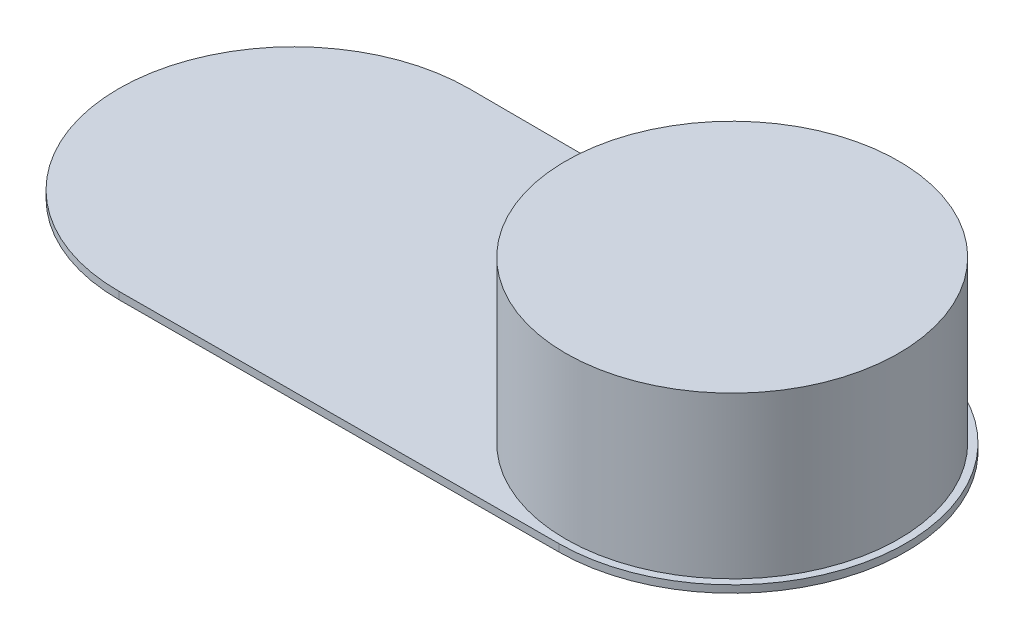
ISO-10303-21;
HEADER;
FILE_DESCRIPTION(('STEP AP214'),'2;1');
FILE_NAME('part.step','',(''),(''),'','','');
FILE_SCHEMA(('AUTOMOTIVE_DESIGN { 1 0 10303 214 1 1 1 1 }'));
ENDSEC;
DATA;
#1=APPLICATION_CONTEXT('core data for automotive mechanical design processes');
#2=APPLICATION_PROTOCOL_DEFINITION('international standard','automotive_design',2000,#1);
#3=PRODUCT_CONTEXT('',#1,'mechanical');
#4=PRODUCT('Part','Part','',(#3));
#5=PRODUCT_RELATED_PRODUCT_CATEGORY('part','',(#4));
#6=PRODUCT_DEFINITION_FORMATION('','',#4);
#7=PRODUCT_DEFINITION_CONTEXT('part definition',#1,'design');
#8=PRODUCT_DEFINITION('design','',#6,#7);
#9=PRODUCT_DEFINITION_SHAPE('','',#8);
#10=(LENGTH_UNIT() NAMED_UNIT(*) SI_UNIT(.MILLI.,.METRE.));
#11=(NAMED_UNIT(*) PLANE_ANGLE_UNIT() SI_UNIT($,.RADIAN.));
#12=(NAMED_UNIT(*) SI_UNIT($,.STERADIAN.) SOLID_ANGLE_UNIT());
#13=UNCERTAINTY_MEASURE_WITH_UNIT(LENGTH_MEASURE(1.E-05),#10,'distance_accuracy_value','');
#14=(GEOMETRIC_REPRESENTATION_CONTEXT(3) GLOBAL_UNCERTAINTY_ASSIGNED_CONTEXT((#13)) GLOBAL_UNIT_ASSIGNED_CONTEXT((#10,
#11,#12)) REPRESENTATION_CONTEXT('',''));
#15=CARTESIAN_POINT('',(0.,0.,0.));
#16=DIRECTION('',(0.,0.,1.));
#17=DIRECTION('',(1.,0.,0.));
#18=AXIS2_PLACEMENT_3D('',#15,#16,#17);
#19=CARTESIAN_POINT('',(0.,5.,0.));
#20=DIRECTION('',(0.,1.,0.));
#21=DIRECTION('',(0.,0.,1.));
#22=AXIS2_PLACEMENT_3D('',#19,#20,#21);
#23=PLANE('',#22);
#24=DIRECTION('',(0.999994444429012,0.,0.00333333333333333));
#25=VECTOR('',#24,1.);
#26=CARTESIAN_POINT('',(0.396666666666666,5.,-118.999338887052));
#27=LINE('',#26,#25);
#28=CARTESIAN_POINT('',(-299.6,5.,-119.999333331481));
#29=VERTEX_POINT('',#28);
#30=CARTESIAN_POINT('',(0.396666666666714,5.,-118.999338887052));
#31=VERTEX_POINT('',#30);
#32=EDGE_CURVE('E88',#29,#31,#27,.T.);
#33=ORIENTED_EDGE('',*,*,#32,.F.);
#34=CARTESIAN_POINT('',(-300.,5.,0.));
#35=DIRECTION('',(0.,1.,0.));
#36=DIRECTION('',(0.,0.,1.));
#37=AXIS2_PLACEMENT_3D('',#34,#35,#36);
#38=CIRCLE('',#37,120.);
#39=CARTESIAN_POINT('',(-299.6,5.,119.999333331481));
#40=VERTEX_POINT('',#39);
#41=EDGE_CURVE('E83',#29,#40,#38,.T.);
#42=ORIENTED_EDGE('',*,*,#41,.T.);
#43=DIRECTION('',(-0.999994444429012,0.,0.00333333333333328));
#44=VECTOR('',#43,1.);
#45=CARTESIAN_POINT('',(0.396666666666661,5.,118.999338887052));
#46=LINE('',#45,#44);
#47=CARTESIAN_POINT('',(0.396666666666688,5.,118.999338887052));
#48=VERTEX_POINT('',#47);
#49=EDGE_CURVE('E87',#48,#40,#46,.T.);
#50=ORIENTED_EDGE('',*,*,#49,.F.);
#51=CARTESIAN_POINT('',(0.,5.,0.));
#52=DIRECTION('',(0.,1.,0.));
#53=DIRECTION('',(0.,0.,1.));
#54=AXIS2_PLACEMENT_3D('',#51,#52,#53);
#55=CIRCLE('',#54,119.);
#56=EDGE_CURVE('E56',#48,#31,#55,.T.);
#57=ORIENTED_EDGE('',*,*,#56,.T.);
#58=EDGE_LOOP('',(#33,#42,#50,#57));
#59=FACE_BOUND('',#58,.T.);
#60=CARTESIAN_POINT('',(0.,5.,0.));
#61=DIRECTION('',(0.,1.,0.));
#62=DIRECTION('',(0.,0.,1.));
#63=AXIS2_PLACEMENT_3D('',#60,#61,#62);
#64=CIRCLE('',#63,114.);
#65=CARTESIAN_POINT('',(0.,5.,114.));
#66=VERTEX_POINT('',#65);
#67=EDGE_CURVE('E107',#66,#66,#64,.T.);
#68=ORIENTED_EDGE('',*,*,#67,.F.);
#69=EDGE_LOOP('',(#68));
#70=FACE_BOUND('',#69,.T.);
#71=ADVANCED_FACE('F39',(#59,#70),#23,.T.);
#72=CARTESIAN_POINT('',(0.396666666666666,5.,-118.999338887052));
#73=DIRECTION('',(0.00333333333333333,0.,-0.999994444429012));
#74=DIRECTION('',(-0.999994444429012,0.,-0.00333333333333333));
#75=AXIS2_PLACEMENT_3D('',#72,#73,#74);
#76=PLANE('',#75);
#77=DIRECTION('',(0.999994444429012,0.,0.00333333333333333));
#78=VECTOR('',#77,1.);
#79=CARTESIAN_POINT('',(0.396666666666666,0.,-118.999338887052));
#80=LINE('',#79,#78);
#81=CARTESIAN_POINT('',(-299.6,0.,-119.999333331481));
#82=VERTEX_POINT('',#81);
#83=CARTESIAN_POINT('',(0.396666666666714,0.,-118.999338887052));
#84=VERTEX_POINT('',#83);
#85=EDGE_CURVE('E106',#82,#84,#80,.T.);
#86=ORIENTED_EDGE('',*,*,#85,.F.);
#87=DIRECTION('',(0.,-1.,0.));
#88=VECTOR('',#87,1.);
#89=CARTESIAN_POINT('',(-299.6,5.,-119.999333331481));
#90=LINE('',#89,#88);
#91=EDGE_CURVE('E11',#29,#82,#90,.T.);
#92=ORIENTED_EDGE('',*,*,#91,.F.);
#93=ORIENTED_EDGE('',*,*,#32,.T.);
#94=DIRECTION('',(0.,-1.,0.));
#95=VECTOR('',#94,1.);
#96=CARTESIAN_POINT('',(0.396666666666714,5.,-118.999338887052));
#97=LINE('',#96,#95);
#98=EDGE_CURVE('E78',#31,#84,#97,.T.);
#99=ORIENTED_EDGE('',*,*,#98,.T.);
#100=EDGE_LOOP('',(#86,#92,#93,#99));
#101=FACE_BOUND('',#100,.T.);
#102=ADVANCED_FACE('F145',(#101),#76,.T.);
#103=CARTESIAN_POINT('',(-300.,5.,0.));
#104=DIRECTION('',(0.,-1.,0.));
#105=DIRECTION('',(0.,0.,-1.));
#106=AXIS2_PLACEMENT_3D('',#103,#104,#105);
#107=CYLINDRICAL_SURFACE('',#106,120.);
#108=CARTESIAN_POINT('',(-300.,0.,0.));
#109=DIRECTION('',(0.,1.,0.));
#110=DIRECTION('',(0.,0.,1.));
#111=AXIS2_PLACEMENT_3D('',#108,#109,#110);
#112=CIRCLE('',#111,120.);
#113=CARTESIAN_POINT('',(-299.6,0.,119.999333331481));
#114=VERTEX_POINT('',#113);
#115=EDGE_CURVE('E94',#82,#114,#112,.T.);
#116=ORIENTED_EDGE('',*,*,#115,.T.);
#117=DIRECTION('',(0.,-1.,0.));
#118=VECTOR('',#117,1.);
#119=CARTESIAN_POINT('',(-299.6,5.,119.999333331481));
#120=LINE('',#119,#118);
#121=EDGE_CURVE('E48',#40,#114,#120,.T.);
#122=ORIENTED_EDGE('',*,*,#121,.F.);
#123=ORIENTED_EDGE('',*,*,#41,.F.);
#124=ORIENTED_EDGE('',*,*,#91,.T.);
#125=EDGE_LOOP('',(#116,#122,#123,#124));
#126=FACE_BOUND('',#125,.T.);
#127=ADVANCED_FACE('F92',(#126),#107,.T.);
#128=CARTESIAN_POINT('',(0.396666666666661,5.,118.999338887052));
#129=DIRECTION('',(0.00333333333333328,0.,0.999994444429012));
#130=DIRECTION('',(0.999994444429012,0.,-0.00333333333333328));
#131=AXIS2_PLACEMENT_3D('',#128,#129,#130);
#132=PLANE('',#131);
#133=DIRECTION('',(-0.999994444429012,0.,0.00333333333333328));
#134=VECTOR('',#133,1.);
#135=CARTESIAN_POINT('',(0.396666666666661,0.,118.999338887052));
#136=LINE('',#135,#134);
#137=CARTESIAN_POINT('',(0.396666666666688,0.,118.999338887052));
#138=VERTEX_POINT('',#137);
#139=EDGE_CURVE('E111',#138,#114,#136,.T.);
#140=ORIENTED_EDGE('',*,*,#139,.F.);
#141=DIRECTION('',(0.,-1.,0.));
#142=VECTOR('',#141,1.);
#143=CARTESIAN_POINT('',(0.396666666666688,5.,118.999338887052));
#144=LINE('',#143,#142);
#145=EDGE_CURVE('E71',#48,#138,#144,.T.);
#146=ORIENTED_EDGE('',*,*,#145,.F.);
#147=ORIENTED_EDGE('',*,*,#49,.T.);
#148=ORIENTED_EDGE('',*,*,#121,.T.);
#149=EDGE_LOOP('',(#140,#146,#147,#148));
#150=FACE_BOUND('',#149,.T.);
#151=ADVANCED_FACE('F98',(#150),#132,.T.);
#152=CARTESIAN_POINT('',(0.,5.,0.));
#153=DIRECTION('',(0.,-1.,0.));
#154=DIRECTION('',(0.,0.,-1.));
#155=AXIS2_PLACEMENT_3D('',#152,#153,#154);
#156=CYLINDRICAL_SURFACE('',#155,109.);
#157=CARTESIAN_POINT('',(0.,0.,0.));
#158=DIRECTION('',(0.,1.,0.));
#159=DIRECTION('',(0.,0.,1.));
#160=AXIS2_PLACEMENT_3D('',#157,#158,#159);
#161=CIRCLE('',#160,109.);
#162=CARTESIAN_POINT('',(0.,0.,109.));
#163=VERTEX_POINT('',#162);
#164=EDGE_CURVE('E103',#163,#163,#161,.T.);
#165=ORIENTED_EDGE('',*,*,#164,.F.);
#166=EDGE_LOOP('',(#165));
#167=FACE_BOUND('',#166,.T.);
#168=CARTESIAN_POINT('',(0.,110.1,0.));
#169=DIRECTION('',(0.,1.,0.));
#170=DIRECTION('',(0.,0.,1.));
#171=AXIS2_PLACEMENT_3D('',#168,#169,#170);
#172=CIRCLE('',#171,109.);
#173=CARTESIAN_POINT('',(0.,110.1,109.));
#174=VERTEX_POINT('',#173);
#175=EDGE_CURVE('E119',#174,#174,#172,.T.);
#176=ORIENTED_EDGE('',*,*,#175,.T.);
#177=EDGE_LOOP('',(#176));
#178=FACE_BOUND('',#177,.T.);
#179=ADVANCED_FACE('F41',(#167,#178),#156,.F.);
#180=CARTESIAN_POINT('',(0.,5.,0.));
#181=DIRECTION('',(0.,-1.,0.));
#182=DIRECTION('',(0.,0.,-1.));
#183=AXIS2_PLACEMENT_3D('',#180,#181,#182);
#184=CYLINDRICAL_SURFACE('',#183,119.);
#185=CARTESIAN_POINT('',(0.,0.,0.));
#186=DIRECTION('',(0.,1.,0.));
#187=DIRECTION('',(0.,0.,1.));
#188=AXIS2_PLACEMENT_3D('',#185,#186,#187);
#189=CIRCLE('',#188,119.);
#190=EDGE_CURVE('E113',#138,#84,#189,.T.);
#191=ORIENTED_EDGE('',*,*,#190,.T.);
#192=ORIENTED_EDGE('',*,*,#98,.F.);
#193=ORIENTED_EDGE('',*,*,#56,.F.);
#194=ORIENTED_EDGE('',*,*,#145,.T.);
#195=EDGE_LOOP('',(#191,#192,#193,#194));
#196=FACE_BOUND('',#195,.T.);
#197=ADVANCED_FACE('F140',(#196),#184,.T.);
#198=CARTESIAN_POINT('',(0.,0.,0.));
#199=DIRECTION('',(0.,1.,0.));
#200=DIRECTION('',(0.,0.,1.));
#201=AXIS2_PLACEMENT_3D('',#198,#199,#200);
#202=PLANE('',#201);
#203=ORIENTED_EDGE('',*,*,#164,.T.);
#204=EDGE_LOOP('',(#203));
#205=FACE_BOUND('',#204,.T.);
#206=ORIENTED_EDGE('',*,*,#85,.T.);
#207=ORIENTED_EDGE('',*,*,#190,.F.);
#208=ORIENTED_EDGE('',*,*,#139,.T.);
#209=ORIENTED_EDGE('',*,*,#115,.F.);
#210=EDGE_LOOP('',(#206,#207,#208,#209));
#211=FACE_BOUND('',#210,.T.);
#212=ADVANCED_FACE('F131',(#205,#211),#202,.F.);
#213=CARTESIAN_POINT('',(0.,110.1,0.));
#214=DIRECTION('',(0.,-1.,0.));
#215=DIRECTION('',(0.,0.,-1.));
#216=AXIS2_PLACEMENT_3D('',#213,#214,#215);
#217=CYLINDRICAL_SURFACE('',#216,114.);
#218=ORIENTED_EDGE('',*,*,#67,.T.);
#219=EDGE_LOOP('',(#218));
#220=FACE_BOUND('',#219,.T.);
#221=CARTESIAN_POINT('',(0.,115.1,0.));
#222=DIRECTION('',(0.,1.,0.));
#223=DIRECTION('',(0.,0.,1.));
#224=AXIS2_PLACEMENT_3D('',#221,#222,#223);
#225=CIRCLE('',#224,114.);
#226=CARTESIAN_POINT('',(0.,115.1,114.));
#227=VERTEX_POINT('',#226);
#228=EDGE_CURVE('E122',#227,#227,#225,.T.);
#229=ORIENTED_EDGE('',*,*,#228,.F.);
#230=EDGE_LOOP('',(#229));
#231=FACE_BOUND('',#230,.T.);
#232=ADVANCED_FACE('F128',(#220,#231),#217,.T.);
#233=CARTESIAN_POINT('',(0.,110.1,0.));
#234=DIRECTION('',(0.,1.,0.));
#235=DIRECTION('',(0.,0.,1.));
#236=AXIS2_PLACEMENT_3D('',#233,#234,#235);
#237=PLANE('',#236);
#238=ORIENTED_EDGE('',*,*,#175,.F.);
#239=EDGE_LOOP('',(#238));
#240=FACE_BOUND('',#239,.T.);
#241=ADVANCED_FACE('F130',(#240),#237,.F.);
#242=CARTESIAN_POINT('',(0.,115.1,0.));
#243=DIRECTION('',(0.,1.,0.));
#244=DIRECTION('',(0.,0.,1.));
#245=AXIS2_PLACEMENT_3D('',#242,#243,#244);
#246=PLANE('',#245);
#247=ORIENTED_EDGE('',*,*,#228,.T.);
#248=EDGE_LOOP('',(#247));
#249=FACE_BOUND('',#248,.T.);
#250=ADVANCED_FACE('F126',(#249),#246,.T.);
#251=CLOSED_SHELL('',(#71,#102,#127,#151,#179,#197,#212,#232,#241,#250));
#252=MANIFOLD_SOLID_BREP('B2',#251);
#253=ADVANCED_BREP_SHAPE_REPRESENTATION('',(#18,#252),#14);
#254=SHAPE_DEFINITION_REPRESENTATION(#9,#253);
ENDSEC;
END-ISO-10303-21;
